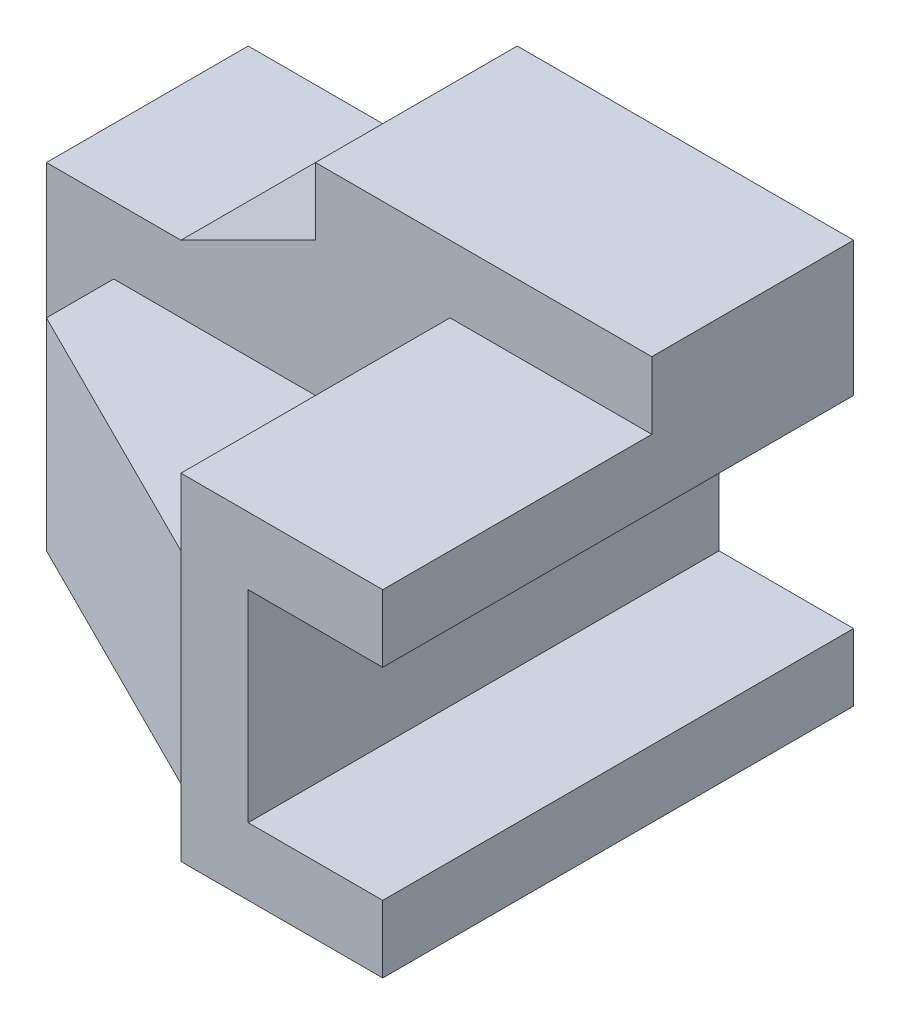
ISO-10303-21;
HEADER;
FILE_DESCRIPTION(('STEP AP214'),'2;1');
FILE_NAME('part.step','',(''),(''),'','','');
FILE_SCHEMA(('AUTOMOTIVE_DESIGN { 1 0 10303 214 1 1 1 1 }'));
ENDSEC;
DATA;
#1=APPLICATION_CONTEXT('core data for automotive mechanical design processes');
#2=APPLICATION_PROTOCOL_DEFINITION('international standard','automotive_design',2000,#1);
#3=PRODUCT_CONTEXT('',#1,'mechanical');
#4=PRODUCT('Part','Part','',(#3));
#5=PRODUCT_RELATED_PRODUCT_CATEGORY('part','',(#4));
#6=PRODUCT_DEFINITION_FORMATION('','',#4);
#7=PRODUCT_DEFINITION_CONTEXT('part definition',#1,'design');
#8=PRODUCT_DEFINITION('design','',#6,#7);
#9=PRODUCT_DEFINITION_SHAPE('','',#8);
#10=(LENGTH_UNIT() NAMED_UNIT(*) SI_UNIT(.MILLI.,.METRE.));
#11=(NAMED_UNIT(*) PLANE_ANGLE_UNIT() SI_UNIT($,.RADIAN.));
#12=(NAMED_UNIT(*) SI_UNIT($,.STERADIAN.) SOLID_ANGLE_UNIT());
#13=UNCERTAINTY_MEASURE_WITH_UNIT(LENGTH_MEASURE(1.E-05),#10,'distance_accuracy_value','');
#14=(GEOMETRIC_REPRESENTATION_CONTEXT(3) GLOBAL_UNCERTAINTY_ASSIGNED_CONTEXT((#13)) GLOBAL_UNIT_ASSIGNED_CONTEXT((#10,
#11,#12)) REPRESENTATION_CONTEXT('',''));
#15=CARTESIAN_POINT('',(0.,0.,0.));
#16=DIRECTION('',(0.,0.,1.));
#17=DIRECTION('',(1.,0.,0.));
#18=AXIS2_PLACEMENT_3D('',#15,#16,#17);
#19=CARTESIAN_POINT('',(90.,30.,0.));
#20=DIRECTION('',(-1.,0.,0.));
#21=DIRECTION('',(0.,0.,1.));
#22=AXIS2_PLACEMENT_3D('',#19,#20,#21);
#23=PLANE('',#22);
#24=DIRECTION('',(0.,-1.,0.));
#25=VECTOR('',#24,1.);
#26=CARTESIAN_POINT('',(90.,30.,0.));
#27=LINE('',#26,#25);
#28=CARTESIAN_POINT('',(90.,9.99999999999999,0.));
#29=VERTEX_POINT('',#28);
#30=CARTESIAN_POINT('',(90.,0.,0.));
#31=VERTEX_POINT('',#30);
#32=EDGE_CURVE('E267',#29,#31,#27,.T.);
#33=ORIENTED_EDGE('',*,*,#32,.F.);
#34=DIRECTION('',(0.,0.,1.));
#35=VECTOR('',#34,1.);
#36=CARTESIAN_POINT('',(90.,9.99999999999999,0.));
#37=LINE('',#36,#35);
#38=CARTESIAN_POINT('',(90.,9.99999999999999,70.));
#39=VERTEX_POINT('',#38);
#40=EDGE_CURVE('E186',#29,#39,#37,.T.);
#41=ORIENTED_EDGE('',*,*,#40,.T.);
#42=DIRECTION('',(0.,-1.,0.));
#43=VECTOR('',#42,1.);
#44=CARTESIAN_POINT('',(90.,30.,70.));
#45=LINE('',#44,#43);
#46=CARTESIAN_POINT('',(90.,0.,70.));
#47=VERTEX_POINT('',#46);
#48=EDGE_CURVE('E231',#39,#47,#45,.T.);
#49=ORIENTED_EDGE('',*,*,#48,.T.);
#50=DIRECTION('',(0.,0.,-1.));
#51=VECTOR('',#50,1.);
#52=CARTESIAN_POINT('',(90.,0.,0.));
#53=LINE('',#52,#51);
#54=EDGE_CURVE('E262',#47,#31,#53,.T.);
#55=ORIENTED_EDGE('',*,*,#54,.T.);
#56=EDGE_LOOP('',(#33,#41,#49,#55));
#57=FACE_BOUND('',#56,.T.);
#58=ADVANCED_FACE('F33',(#57),#23,.F.);
#59=CARTESIAN_POINT('',(0.,30.,0.));
#60=DIRECTION('',(0.,-1.,0.));
#61=DIRECTION('',(0.,0.,-1.));
#62=AXIS2_PLACEMENT_3D('',#59,#60,#61);
#63=PLANE('',#62);
#64=DIRECTION('',(0.,0.,1.));
#65=VECTOR('',#64,1.);
#66=CARTESIAN_POINT('',(60.,30.,70.));
#67=LINE('',#66,#65);
#68=CARTESIAN_POINT('',(60.,30.,30.));
#69=VERTEX_POINT('',#68);
#70=CARTESIAN_POINT('',(60.,30.,60.));
#71=VERTEX_POINT('',#70);
#72=EDGE_CURVE('E182',#69,#71,#67,.T.);
#73=ORIENTED_EDGE('',*,*,#72,.F.);
#74=DIRECTION('',(1.,0.,0.));
#75=VECTOR('',#74,1.);
#76=CARTESIAN_POINT('',(60.,30.,30.));
#77=LINE('',#76,#75);
#78=CARTESIAN_POINT('',(10.,30.,30.));
#79=VERTEX_POINT('',#78);
#80=EDGE_CURVE('E41',#79,#69,#77,.T.);
#81=ORIENTED_EDGE('',*,*,#80,.F.);
#82=DIRECTION('',(0.,0.,1.));
#83=VECTOR('',#82,1.);
#84=CARTESIAN_POINT('',(10.,30.,40.));
#85=LINE('',#84,#83);
#86=CARTESIAN_POINT('',(10.,30.,40.));
#87=VERTEX_POINT('',#86);
#88=EDGE_CURVE('E204',#79,#87,#85,.T.);
#89=ORIENTED_EDGE('',*,*,#88,.T.);
#90=DIRECTION('',(0.894427190999916,0.,0.447213595499958));
#91=VECTOR('',#90,1.);
#92=CARTESIAN_POINT('',(50.,30.,60.));
#93=LINE('',#92,#91);
#94=CARTESIAN_POINT('',(50.,30.,60.));
#95=VERTEX_POINT('',#94);
#96=EDGE_CURVE('E187',#87,#95,#93,.T.);
#97=ORIENTED_EDGE('',*,*,#96,.T.);
#98=DIRECTION('',(1.,0.,0.));
#99=VECTOR('',#98,1.);
#100=CARTESIAN_POINT('',(60.,30.,60.));
#101=LINE('',#100,#99);
#102=EDGE_CURVE('E209',#95,#71,#101,.T.);
#103=ORIENTED_EDGE('',*,*,#102,.T.);
#104=EDGE_LOOP('',(#73,#81,#89,#97,#103));
#105=FACE_BOUND('',#104,.T.);
#106=ADVANCED_FACE('F292',(#105),#63,.F.);
#107=CARTESIAN_POINT('',(0.,30.,30.));
#108=DIRECTION('',(1.,0.,0.));
#109=DIRECTION('',(0.,0.,-1.));
#110=AXIS2_PLACEMENT_3D('',#107,#108,#109);
#111=PLANE('',#110);
#112=DIRECTION('',(0.,-1.,0.));
#113=VECTOR('',#112,1.);
#114=CARTESIAN_POINT('',(0.,30.,30.));
#115=LINE('',#114,#113);
#116=CARTESIAN_POINT('',(0.,40.,30.));
#117=VERTEX_POINT('',#116);
#118=CARTESIAN_POINT('',(0.,0.,30.));
#119=VERTEX_POINT('',#118);
#120=EDGE_CURVE('E192',#117,#119,#115,.T.);
#121=ORIENTED_EDGE('',*,*,#120,.F.);
#122=DIRECTION('',(0.,0.,-1.));
#123=VECTOR('',#122,1.);
#124=CARTESIAN_POINT('',(0.,40.,70.));
#125=LINE('',#124,#123);
#126=CARTESIAN_POINT('',(0.,40.,0.));
#127=VERTEX_POINT('',#126);
#128=EDGE_CURVE('E374',#117,#127,#125,.T.);
#129=ORIENTED_EDGE('',*,*,#128,.T.);
#130=DIRECTION('',(0.,-1.,0.));
#131=VECTOR('',#130,1.);
#132=CARTESIAN_POINT('',(0.,30.,0.));
#133=LINE('',#132,#131);
#134=CARTESIAN_POINT('',(0.,0.,0.));
#135=VERTEX_POINT('',#134);
#136=EDGE_CURVE('E211',#127,#135,#133,.T.);
#137=ORIENTED_EDGE('',*,*,#136,.T.);
#138=DIRECTION('',(0.,0.,1.));
#139=VECTOR('',#138,1.);
#140=CARTESIAN_POINT('',(0.,0.,30.));
#141=LINE('',#140,#139);
#142=EDGE_CURVE('E177',#135,#119,#141,.T.);
#143=ORIENTED_EDGE('',*,*,#142,.T.);
#144=EDGE_LOOP('',(#121,#129,#137,#143));
#145=FACE_BOUND('',#144,.T.);
#146=ADVANCED_FACE('F35',(#145),#111,.F.);
#147=CARTESIAN_POINT('',(10.,30.,30.));
#148=DIRECTION('',(0.,0.,-1.));
#149=DIRECTION('',(-1.,0.,0.));
#150=AXIS2_PLACEMENT_3D('',#147,#148,#149);
#151=PLANE('',#150);
#152=DIRECTION('',(-0.894427190999916,-0.447213595499958,0.));
#153=VECTOR('',#152,1.);
#154=CARTESIAN_POINT('',(8.,34.,30.));
#155=LINE('',#154,#153);
#156=CARTESIAN_POINT('',(40.,50.,30.));
#157=VERTEX_POINT('',#156);
#158=CARTESIAN_POINT('',(20.,40.,30.));
#159=VERTEX_POINT('',#158);
#160=EDGE_CURVE('E371',#157,#159,#155,.T.);
#161=ORIENTED_EDGE('',*,*,#160,.T.);
#162=DIRECTION('',(-1.,0.,0.));
#163=VECTOR('',#162,1.);
#164=CARTESIAN_POINT('',(10.,40.,30.));
#165=LINE('',#164,#163);
#166=EDGE_CURVE('E368',#159,#117,#165,.T.);
#167=ORIENTED_EDGE('',*,*,#166,.T.);
#168=ORIENTED_EDGE('',*,*,#120,.T.);
#169=DIRECTION('',(1.,0.,0.));
#170=VECTOR('',#169,1.);
#171=CARTESIAN_POINT('',(10.,0.,30.));
#172=LINE('',#171,#170);
#173=CARTESIAN_POINT('',(10.,0.,30.));
#174=VERTEX_POINT('',#173);
#175=EDGE_CURVE('E255',#119,#174,#172,.T.);
#176=ORIENTED_EDGE('',*,*,#175,.T.);
#177=DIRECTION('',(0.,-1.,0.));
#178=VECTOR('',#177,1.);
#179=CARTESIAN_POINT('',(10.,30.,30.));
#180=LINE('',#179,#178);
#181=EDGE_CURVE('E198',#79,#174,#180,.T.);
#182=ORIENTED_EDGE('',*,*,#181,.F.);
#183=ORIENTED_EDGE('',*,*,#80,.T.);
#184=DIRECTION('',(0.,-1.,0.));
#185=VECTOR('',#184,1.);
#186=CARTESIAN_POINT('',(60.,60.,30.));
#187=LINE('',#186,#185);
#188=CARTESIAN_POINT('',(60.,50.,30.));
#189=VERTEX_POINT('',#188);
#190=EDGE_CURVE('E175',#189,#69,#187,.T.);
#191=ORIENTED_EDGE('',*,*,#190,.F.);
#192=DIRECTION('',(1.,0.,0.));
#193=VECTOR('',#192,1.);
#194=CARTESIAN_POINT('',(90.,50.,30.));
#195=LINE('',#194,#193);
#196=CARTESIAN_POINT('',(90.,50.,30.));
#197=VERTEX_POINT('',#196);
#198=EDGE_CURVE('E295',#189,#197,#195,.T.);
#199=ORIENTED_EDGE('',*,*,#198,.T.);
#200=DIRECTION('',(0.,1.,0.));
#201=VECTOR('',#200,1.);
#202=CARTESIAN_POINT('',(90.,60.,30.));
#203=LINE('',#202,#201);
#204=CARTESIAN_POINT('',(90.,60.,30.));
#205=VERTEX_POINT('',#204);
#206=EDGE_CURVE('E306',#197,#205,#203,.T.);
#207=ORIENTED_EDGE('',*,*,#206,.T.);
#208=DIRECTION('',(1.,0.,0.));
#209=VECTOR('',#208,1.);
#210=CARTESIAN_POINT('',(60.,60.,30.));
#211=LINE('',#210,#209);
#212=CARTESIAN_POINT('',(40.,60.,30.));
#213=VERTEX_POINT('',#212);
#214=EDGE_CURVE('E54',#213,#205,#211,.T.);
#215=ORIENTED_EDGE('',*,*,#214,.F.);
#216=DIRECTION('',(0.,-1.,0.));
#217=VECTOR('',#216,1.);
#218=CARTESIAN_POINT('',(40.,30.,30.));
#219=LINE('',#218,#217);
#220=EDGE_CURVE('E48',#213,#157,#219,.T.);
#221=ORIENTED_EDGE('',*,*,#220,.T.);
#222=EDGE_LOOP('',(#161,#167,#168,#176,#182,#183,#191,#199,#207,#215,#221));
#223=FACE_BOUND('',#222,.T.);
#224=ADVANCED_FACE('F287',(#223),#151,.F.);
#225=CARTESIAN_POINT('',(10.,30.,40.));
#226=DIRECTION('',(1.,0.,0.));
#227=DIRECTION('',(0.,0.,-1.));
#228=AXIS2_PLACEMENT_3D('',#225,#226,#227);
#229=PLANE('',#228);
#230=DIRECTION('',(0.,0.,1.));
#231=VECTOR('',#230,1.);
#232=CARTESIAN_POINT('',(10.,0.,40.));
#233=LINE('',#232,#231);
#234=CARTESIAN_POINT('',(10.,0.,40.));
#235=VERTEX_POINT('',#234);
#236=EDGE_CURVE('E250',#174,#235,#233,.T.);
#237=ORIENTED_EDGE('',*,*,#236,.T.);
#238=DIRECTION('',(0.,-1.,0.));
#239=VECTOR('',#238,1.);
#240=CARTESIAN_POINT('',(10.,30.,40.));
#241=LINE('',#240,#239);
#242=EDGE_CURVE('E201',#87,#235,#241,.T.);
#243=ORIENTED_EDGE('',*,*,#242,.F.);
#244=ORIENTED_EDGE('',*,*,#88,.F.);
#245=ORIENTED_EDGE('',*,*,#181,.T.);
#246=EDGE_LOOP('',(#237,#243,#244,#245));
#247=FACE_BOUND('',#246,.T.);
#248=ADVANCED_FACE('F289',(#247),#229,.F.);
#249=CARTESIAN_POINT('',(50.,30.,60.));
#250=DIRECTION('',(0.447213595499958,0.,-0.894427190999916));
#251=DIRECTION('',(-0.894427190999916,0.,-0.447213595499958));
#252=AXIS2_PLACEMENT_3D('',#249,#250,#251);
#253=PLANE('',#252);
#254=DIRECTION('',(0.894427190999916,0.,0.447213595499958));
#255=VECTOR('',#254,1.);
#256=CARTESIAN_POINT('',(50.,0.,60.));
#257=LINE('',#256,#255);
#258=CARTESIAN_POINT('',(50.,0.,60.));
#259=VERTEX_POINT('',#258);
#260=EDGE_CURVE('E241',#235,#259,#257,.T.);
#261=ORIENTED_EDGE('',*,*,#260,.T.);
#262=DIRECTION('',(0.,-1.,0.));
#263=VECTOR('',#262,1.);
#264=CARTESIAN_POINT('',(50.,30.,60.));
#265=LINE('',#264,#263);
#266=EDGE_CURVE('E216',#95,#259,#265,.T.);
#267=ORIENTED_EDGE('',*,*,#266,.F.);
#268=ORIENTED_EDGE('',*,*,#96,.F.);
#269=ORIENTED_EDGE('',*,*,#242,.T.);
#270=EDGE_LOOP('',(#261,#267,#268,#269));
#271=FACE_BOUND('',#270,.T.);
#272=ADVANCED_FACE('F239',(#271),#253,.F.);
#273=CARTESIAN_POINT('',(60.,30.,60.));
#274=DIRECTION('',(0.,0.,-1.));
#275=DIRECTION('',(-1.,0.,0.));
#276=AXIS2_PLACEMENT_3D('',#273,#274,#275);
#277=PLANE('',#276);
#278=DIRECTION('',(1.,0.,0.));
#279=VECTOR('',#278,1.);
#280=CARTESIAN_POINT('',(60.,0.,60.));
#281=LINE('',#280,#279);
#282=CARTESIAN_POINT('',(60.,0.,60.));
#283=VERTEX_POINT('',#282);
#284=EDGE_CURVE('E251',#259,#283,#281,.T.);
#285=ORIENTED_EDGE('',*,*,#284,.T.);
#286=DIRECTION('',(0.,-1.,0.));
#287=VECTOR('',#286,1.);
#288=CARTESIAN_POINT('',(60.,30.,60.));
#289=LINE('',#288,#287);
#290=EDGE_CURVE('E214',#71,#283,#289,.T.);
#291=ORIENTED_EDGE('',*,*,#290,.F.);
#292=ORIENTED_EDGE('',*,*,#102,.F.);
#293=ORIENTED_EDGE('',*,*,#266,.T.);
#294=EDGE_LOOP('',(#285,#291,#292,#293));
#295=FACE_BOUND('',#294,.T.);
#296=ADVANCED_FACE('F399',(#295),#277,.F.);
#297=CARTESIAN_POINT('',(60.,30.,70.));
#298=DIRECTION('',(1.,0.,0.));
#299=DIRECTION('',(0.,0.,-1.));
#300=AXIS2_PLACEMENT_3D('',#297,#298,#299);
#301=PLANE('',#300);
#302=DIRECTION('',(0.,-1.,0.));
#303=VECTOR('',#302,1.);
#304=CARTESIAN_POINT('',(60.,30.,70.));
#305=LINE('',#304,#303);
#306=CARTESIAN_POINT('',(60.,50.,70.));
#307=VERTEX_POINT('',#306);
#308=CARTESIAN_POINT('',(60.,0.,70.));
#309=VERTEX_POINT('',#308);
#310=EDGE_CURVE('E217',#307,#309,#305,.T.);
#311=ORIENTED_EDGE('',*,*,#310,.F.);
#312=DIRECTION('',(0.,0.,1.));
#313=VECTOR('',#312,1.);
#314=CARTESIAN_POINT('',(60.,50.,30.));
#315=LINE('',#314,#313);
#316=EDGE_CURVE('E299',#189,#307,#315,.T.);
#317=ORIENTED_EDGE('',*,*,#316,.F.);
#318=ORIENTED_EDGE('',*,*,#190,.T.);
#319=ORIENTED_EDGE('',*,*,#72,.T.);
#320=ORIENTED_EDGE('',*,*,#290,.T.);
#321=DIRECTION('',(0.,0.,1.));
#322=VECTOR('',#321,1.);
#323=CARTESIAN_POINT('',(60.,0.,70.));
#324=LINE('',#323,#322);
#325=EDGE_CURVE('E253',#283,#309,#324,.T.);
#326=ORIENTED_EDGE('',*,*,#325,.T.);
#327=EDGE_LOOP('',(#311,#317,#318,#319,#320,#326));
#328=FACE_BOUND('',#327,.T.);
#329=ADVANCED_FACE('F298',(#328),#301,.F.);
#330=CARTESIAN_POINT('',(90.,30.,70.));
#331=DIRECTION('',(0.,0.,-1.));
#332=DIRECTION('',(-1.,0.,0.));
#333=AXIS2_PLACEMENT_3D('',#330,#331,#332);
#334=PLANE('',#333);
#335=CARTESIAN_POINT('',(90.,50.,70.));
#336=VERTEX_POINT('',#335);
#337=CARTESIAN_POINT('',(90.,40.,70.));
#338=VERTEX_POINT('',#337);
#339=EDGE_CURVE('E225',#336,#338,#45,.T.);
#340=ORIENTED_EDGE('',*,*,#339,.F.);
#341=DIRECTION('',(1.,0.,0.));
#342=VECTOR('',#341,1.);
#343=CARTESIAN_POINT('',(90.,50.,70.));
#344=LINE('',#343,#342);
#345=EDGE_CURVE('E366',#307,#336,#344,.T.);
#346=ORIENTED_EDGE('',*,*,#345,.F.);
#347=ORIENTED_EDGE('',*,*,#310,.T.);
#348=DIRECTION('',(1.,0.,0.));
#349=VECTOR('',#348,1.);
#350=CARTESIAN_POINT('',(90.,0.,70.));
#351=LINE('',#350,#349);
#352=EDGE_CURVE('E260',#309,#47,#351,.T.);
#353=ORIENTED_EDGE('',*,*,#352,.T.);
#354=ORIENTED_EDGE('',*,*,#48,.F.);
#355=DIRECTION('',(1.,0.,0.));
#356=VECTOR('',#355,1.);
#357=CARTESIAN_POINT('',(90.,9.99999999999999,70.));
#358=LINE('',#357,#356);
#359=CARTESIAN_POINT('',(70.,9.99999999999999,70.));
#360=VERTEX_POINT('',#359);
#361=EDGE_CURVE('E313',#360,#39,#358,.T.);
#362=ORIENTED_EDGE('',*,*,#361,.F.);
#363=DIRECTION('',(0.,-1.,0.));
#364=VECTOR('',#363,1.);
#365=CARTESIAN_POINT('',(70.,9.99999999999999,70.));
#366=LINE('',#365,#364);
#367=CARTESIAN_POINT('',(70.,40.,70.));
#368=VERTEX_POINT('',#367);
#369=EDGE_CURVE('E319',#368,#360,#366,.T.);
#370=ORIENTED_EDGE('',*,*,#369,.F.);
#371=DIRECTION('',(-1.,0.,0.));
#372=VECTOR('',#371,1.);
#373=CARTESIAN_POINT('',(90.,40.,70.));
#374=LINE('',#373,#372);
#375=EDGE_CURVE('E304',#338,#368,#374,.T.);
#376=ORIENTED_EDGE('',*,*,#375,.F.);
#377=EDGE_LOOP('',(#340,#346,#347,#353,#354,#362,#370,#376));
#378=FACE_BOUND('',#377,.T.);
#379=ADVANCED_FACE('F337',(#378),#334,.F.);
#380=ORIENTED_EDGE('',*,*,#206,.F.);
#381=DIRECTION('',(0.,0.,1.));
#382=VECTOR('',#381,1.);
#383=CARTESIAN_POINT('',(90.,50.,30.));
#384=LINE('',#383,#382);
#385=EDGE_CURVE('E301',#197,#336,#384,.T.);
#386=ORIENTED_EDGE('',*,*,#385,.T.);
#387=ORIENTED_EDGE('',*,*,#339,.T.);
#388=DIRECTION('',(0.,0.,1.));
#389=VECTOR('',#388,1.);
#390=CARTESIAN_POINT('',(90.,40.,0.));
#391=LINE('',#390,#389);
#392=CARTESIAN_POINT('',(90.,40.,0.));
#393=VERTEX_POINT('',#392);
#394=EDGE_CURVE('E316',#393,#338,#391,.T.);
#395=ORIENTED_EDGE('',*,*,#394,.F.);
#396=CARTESIAN_POINT('',(90.,60.,0.));
#397=VERTEX_POINT('',#396);
#398=EDGE_CURVE('E268',#397,#393,#27,.T.);
#399=ORIENTED_EDGE('',*,*,#398,.F.);
#400=DIRECTION('',(0.,0.,-1.));
#401=VECTOR('',#400,1.);
#402=CARTESIAN_POINT('',(90.,60.,0.));
#403=LINE('',#402,#401);
#404=EDGE_CURVE('E173',#205,#397,#403,.T.);
#405=ORIENTED_EDGE('',*,*,#404,.F.);
#406=EDGE_LOOP('',(#380,#386,#387,#395,#399,#405));
#407=FACE_BOUND('',#406,.T.);
#408=ADVANCED_FACE('F354',(#407),#23,.F.);
#409=CARTESIAN_POINT('',(0.,30.,0.));
#410=DIRECTION('',(0.,0.,1.));
#411=DIRECTION('',(1.,0.,0.));
#412=AXIS2_PLACEMENT_3D('',#409,#410,#411);
#413=PLANE('',#412);
#414=ORIENTED_EDGE('',*,*,#136,.F.);
#415=DIRECTION('',(-1.,0.,0.));
#416=VECTOR('',#415,1.);
#417=CARTESIAN_POINT('',(20.,40.,0.));
#418=LINE('',#417,#416);
#419=CARTESIAN_POINT('',(20.,40.,0.));
#420=VERTEX_POINT('',#419);
#421=EDGE_CURVE('E378',#420,#127,#418,.T.);
#422=ORIENTED_EDGE('',*,*,#421,.F.);
#423=DIRECTION('',(-0.894427190999916,-0.447213595499958,0.));
#424=VECTOR('',#423,1.);
#425=CARTESIAN_POINT('',(40.,50.,0.));
#426=LINE('',#425,#424);
#427=CARTESIAN_POINT('',(40.,50.,0.));
#428=VERTEX_POINT('',#427);
#429=EDGE_CURVE('E169',#428,#420,#426,.T.);
#430=ORIENTED_EDGE('',*,*,#429,.F.);
#431=DIRECTION('',(0.,-1.,0.));
#432=VECTOR('',#431,1.);
#433=CARTESIAN_POINT('',(40.,60.,0.));
#434=LINE('',#433,#432);
#435=CARTESIAN_POINT('',(40.,60.,0.));
#436=VERTEX_POINT('',#435);
#437=EDGE_CURVE('E158',#436,#428,#434,.T.);
#438=ORIENTED_EDGE('',*,*,#437,.F.);
#439=DIRECTION('',(-1.,0.,0.));
#440=VECTOR('',#439,1.);
#441=CARTESIAN_POINT('',(0.,60.,0.));
#442=LINE('',#441,#440);
#443=EDGE_CURVE('E166',#397,#436,#442,.T.);
#444=ORIENTED_EDGE('',*,*,#443,.F.);
#445=ORIENTED_EDGE('',*,*,#398,.T.);
#446=DIRECTION('',(-1.,0.,0.));
#447=VECTOR('',#446,1.);
#448=CARTESIAN_POINT('',(90.,40.,0.));
#449=LINE('',#448,#447);
#450=CARTESIAN_POINT('',(70.,40.,0.));
#451=VERTEX_POINT('',#450);
#452=EDGE_CURVE('E310',#393,#451,#449,.T.);
#453=ORIENTED_EDGE('',*,*,#452,.T.);
#454=DIRECTION('',(0.,-1.,0.));
#455=VECTOR('',#454,1.);
#456=CARTESIAN_POINT('',(70.,9.99999999999999,0.));
#457=LINE('',#456,#455);
#458=CARTESIAN_POINT('',(70.,9.99999999999999,0.));
#459=VERTEX_POINT('',#458);
#460=EDGE_CURVE('E312',#451,#459,#457,.T.);
#461=ORIENTED_EDGE('',*,*,#460,.T.);
#462=DIRECTION('',(1.,0.,0.));
#463=VECTOR('',#462,1.);
#464=CARTESIAN_POINT('',(90.,9.99999999999999,0.));
#465=LINE('',#464,#463);
#466=EDGE_CURVE('E275',#459,#29,#465,.T.);
#467=ORIENTED_EDGE('',*,*,#466,.T.);
#468=ORIENTED_EDGE('',*,*,#32,.T.);
#469=DIRECTION('',(-1.,0.,0.));
#470=VECTOR('',#469,1.);
#471=CARTESIAN_POINT('',(0.,0.,0.));
#472=LINE('',#471,#470);
#473=EDGE_CURVE('E206',#31,#135,#472,.T.);
#474=ORIENTED_EDGE('',*,*,#473,.T.);
#475=EDGE_LOOP('',(#414,#422,#430,#438,#444,#445,#453,#461,#467,#468,#474));
#476=FACE_BOUND('',#475,.T.);
#477=ADVANCED_FACE('F164',(#476),#413,.F.);
#478=CARTESIAN_POINT('',(0.,0.,0.));
#479=DIRECTION('',(0.,-1.,0.));
#480=DIRECTION('',(0.,0.,-1.));
#481=AXIS2_PLACEMENT_3D('',#478,#479,#480);
#482=PLANE('',#481);
#483=ORIENTED_EDGE('',*,*,#142,.F.);
#484=ORIENTED_EDGE('',*,*,#473,.F.);
#485=ORIENTED_EDGE('',*,*,#54,.F.);
#486=ORIENTED_EDGE('',*,*,#352,.F.);
#487=ORIENTED_EDGE('',*,*,#325,.F.);
#488=ORIENTED_EDGE('',*,*,#284,.F.);
#489=ORIENTED_EDGE('',*,*,#260,.F.);
#490=ORIENTED_EDGE('',*,*,#236,.F.);
#491=ORIENTED_EDGE('',*,*,#175,.F.);
#492=EDGE_LOOP('',(#483,#484,#485,#486,#487,#488,#489,#490,#491));
#493=FACE_BOUND('',#492,.T.);
#494=ADVANCED_FACE('F248',(#493),#482,.T.);
#495=CARTESIAN_POINT('',(0.,60.,0.));
#496=DIRECTION('',(0.,-1.,0.));
#497=DIRECTION('',(0.,0.,-1.));
#498=AXIS2_PLACEMENT_3D('',#495,#496,#497);
#499=PLANE('',#498);
#500=ORIENTED_EDGE('',*,*,#443,.T.);
#501=DIRECTION('',(0.,0.,1.));
#502=VECTOR('',#501,1.);
#503=CARTESIAN_POINT('',(40.,60.,0.));
#504=LINE('',#503,#502);
#505=EDGE_CURVE('E11',#436,#213,#504,.T.);
#506=ORIENTED_EDGE('',*,*,#505,.T.);
#507=ORIENTED_EDGE('',*,*,#214,.T.);
#508=ORIENTED_EDGE('',*,*,#404,.T.);
#509=EDGE_LOOP('',(#500,#506,#507,#508));
#510=FACE_BOUND('',#509,.T.);
#511=ADVANCED_FACE('F171',(#510),#499,.F.);
#512=CARTESIAN_POINT('',(90.,9.99999999999999,0.));
#513=DIRECTION('',(0.,-1.,0.));
#514=DIRECTION('',(0.,0.,-1.));
#515=AXIS2_PLACEMENT_3D('',#512,#513,#514);
#516=PLANE('',#515);
#517=ORIENTED_EDGE('',*,*,#361,.T.);
#518=ORIENTED_EDGE('',*,*,#40,.F.);
#519=ORIENTED_EDGE('',*,*,#466,.F.);
#520=DIRECTION('',(0.,0.,1.));
#521=VECTOR('',#520,1.);
#522=CARTESIAN_POINT('',(70.,9.99999999999999,0.));
#523=LINE('',#522,#521);
#524=EDGE_CURVE('E324',#459,#360,#523,.T.);
#525=ORIENTED_EDGE('',*,*,#524,.T.);
#526=EDGE_LOOP('',(#517,#518,#519,#525));
#527=FACE_BOUND('',#526,.T.);
#528=ADVANCED_FACE('F342',(#527),#516,.F.);
#529=CARTESIAN_POINT('',(70.,9.99999999999999,0.));
#530=DIRECTION('',(-1.,0.,0.));
#531=DIRECTION('',(0.,0.,1.));
#532=AXIS2_PLACEMENT_3D('',#529,#530,#531);
#533=PLANE('',#532);
#534=ORIENTED_EDGE('',*,*,#369,.T.);
#535=ORIENTED_EDGE('',*,*,#524,.F.);
#536=ORIENTED_EDGE('',*,*,#460,.F.);
#537=DIRECTION('',(0.,0.,1.));
#538=VECTOR('',#537,1.);
#539=CARTESIAN_POINT('',(70.,40.,0.));
#540=LINE('',#539,#538);
#541=EDGE_CURVE('E326',#451,#368,#540,.T.);
#542=ORIENTED_EDGE('',*,*,#541,.T.);
#543=EDGE_LOOP('',(#534,#535,#536,#542));
#544=FACE_BOUND('',#543,.T.);
#545=ADVANCED_FACE('F340',(#544),#533,.F.);
#546=CARTESIAN_POINT('',(90.,40.,0.));
#547=DIRECTION('',(0.,1.,0.));
#548=DIRECTION('',(0.,0.,1.));
#549=AXIS2_PLACEMENT_3D('',#546,#547,#548);
#550=PLANE('',#549);
#551=ORIENTED_EDGE('',*,*,#375,.T.);
#552=ORIENTED_EDGE('',*,*,#541,.F.);
#553=ORIENTED_EDGE('',*,*,#452,.F.);
#554=ORIENTED_EDGE('',*,*,#394,.T.);
#555=EDGE_LOOP('',(#551,#552,#553,#554));
#556=FACE_BOUND('',#555,.T.);
#557=ADVANCED_FACE('F332',(#556),#550,.F.);
#558=CARTESIAN_POINT('',(90.,50.,30.));
#559=DIRECTION('',(0.,-1.,0.));
#560=DIRECTION('',(1.,0.,0.));
#561=AXIS2_PLACEMENT_3D('',#558,#559,#560);
#562=PLANE('',#561);
#563=ORIENTED_EDGE('',*,*,#345,.T.);
#564=ORIENTED_EDGE('',*,*,#385,.F.);
#565=ORIENTED_EDGE('',*,*,#198,.F.);
#566=ORIENTED_EDGE('',*,*,#316,.T.);
#567=EDGE_LOOP('',(#563,#564,#565,#566));
#568=FACE_BOUND('',#567,.T.);
#569=ADVANCED_FACE('F425',(#568),#562,.F.);
#570=CARTESIAN_POINT('',(20.,40.,70.));
#571=DIRECTION('',(0.,-1.,0.));
#572=DIRECTION('',(0.,0.,-1.));
#573=AXIS2_PLACEMENT_3D('',#570,#571,#572);
#574=PLANE('',#573);
#575=DIRECTION('',(0.,0.,-1.));
#576=VECTOR('',#575,1.);
#577=CARTESIAN_POINT('',(20.,40.,70.));
#578=LINE('',#577,#576);
#579=EDGE_CURVE('E377',#159,#420,#578,.T.);
#580=ORIENTED_EDGE('',*,*,#579,.T.);
#581=ORIENTED_EDGE('',*,*,#421,.T.);
#582=ORIENTED_EDGE('',*,*,#128,.F.);
#583=ORIENTED_EDGE('',*,*,#166,.F.);
#584=EDGE_LOOP('',(#580,#581,#582,#583));
#585=FACE_BOUND('',#584,.T.);
#586=ADVANCED_FACE('F387',(#585),#574,.F.);
#587=CARTESIAN_POINT('',(40.,50.,70.));
#588=DIRECTION('',(0.447213595499958,-0.894427190999916,0.));
#589=DIRECTION('',(0.894427190999916,0.447213595499958,0.));
#590=AXIS2_PLACEMENT_3D('',#587,#588,#589);
#591=PLANE('',#590);
#592=DIRECTION('',(0.,0.,-1.));
#593=VECTOR('',#592,1.);
#594=CARTESIAN_POINT('',(40.,50.,70.));
#595=LINE('',#594,#593);
#596=EDGE_CURVE('E375',#157,#428,#595,.T.);
#597=ORIENTED_EDGE('',*,*,#596,.T.);
#598=ORIENTED_EDGE('',*,*,#429,.T.);
#599=ORIENTED_EDGE('',*,*,#579,.F.);
#600=ORIENTED_EDGE('',*,*,#160,.F.);
#601=EDGE_LOOP('',(#597,#598,#599,#600));
#602=FACE_BOUND('',#601,.T.);
#603=ADVANCED_FACE('F385',(#602),#591,.F.);
#604=CARTESIAN_POINT('',(40.,60.,70.));
#605=DIRECTION('',(1.,0.,0.));
#606=DIRECTION('',(0.,0.,-1.));
#607=AXIS2_PLACEMENT_3D('',#604,#605,#606);
#608=PLANE('',#607);
#609=ORIENTED_EDGE('',*,*,#505,.F.);
#610=ORIENTED_EDGE('',*,*,#437,.T.);
#611=ORIENTED_EDGE('',*,*,#596,.F.);
#612=ORIENTED_EDGE('',*,*,#220,.F.);
#613=EDGE_LOOP('',(#609,#610,#611,#612));
#614=FACE_BOUND('',#613,.T.);
#615=ADVANCED_FACE('F157',(#614),#608,.F.);
#616=CLOSED_SHELL('',(#58,#106,#146,#224,#248,#272,#296,#329,#379,#408,#477,#494,#511,#528,#545,
#557,#569,#586,#603,#615));
#617=MANIFOLD_SOLID_BREP('B2',#616);
#618=ADVANCED_BREP_SHAPE_REPRESENTATION('',(#18,#617),#14);
#619=SHAPE_DEFINITION_REPRESENTATION(#9,#618);
ENDSEC;
END-ISO-10303-21;
